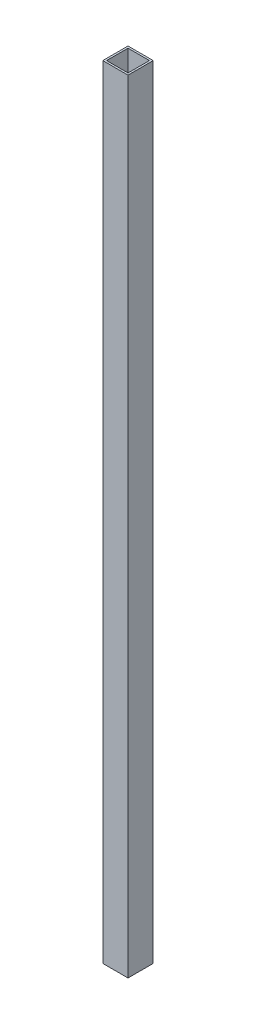
ISO-10303-21;
HEADER;
FILE_DESCRIPTION(('STEP AP214'),'2;1');
FILE_NAME('part.step','',(''),(''),'','','');
FILE_SCHEMA(('AUTOMOTIVE_DESIGN { 1 0 10303 214 1 1 1 1 }'));
ENDSEC;
DATA;
#1=APPLICATION_CONTEXT('core data for automotive mechanical design processes');
#2=APPLICATION_PROTOCOL_DEFINITION('international standard','automotive_design',2000,#1);
#3=PRODUCT_CONTEXT('',#1,'mechanical');
#4=PRODUCT('Part','Part','',(#3));
#5=PRODUCT_RELATED_PRODUCT_CATEGORY('part','',(#4));
#6=PRODUCT_DEFINITION_FORMATION('','',#4);
#7=PRODUCT_DEFINITION_CONTEXT('part definition',#1,'design');
#8=PRODUCT_DEFINITION('design','',#6,#7);
#9=PRODUCT_DEFINITION_SHAPE('','',#8);
#10=(LENGTH_UNIT() NAMED_UNIT(*) SI_UNIT(.MILLI.,.METRE.));
#11=(NAMED_UNIT(*) PLANE_ANGLE_UNIT() SI_UNIT($,.RADIAN.));
#12=(NAMED_UNIT(*) SI_UNIT($,.STERADIAN.) SOLID_ANGLE_UNIT());
#13=UNCERTAINTY_MEASURE_WITH_UNIT(LENGTH_MEASURE(1.E-05),#10,'distance_accuracy_value','');
#14=(GEOMETRIC_REPRESENTATION_CONTEXT(3) GLOBAL_UNCERTAINTY_ASSIGNED_CONTEXT((#13)) GLOBAL_UNIT_ASSIGNED_CONTEXT((#10,
#11,#12)) REPRESENTATION_CONTEXT('',''));
#15=CARTESIAN_POINT('',(0.,0.,0.));
#16=DIRECTION('',(0.,0.,1.));
#17=DIRECTION('',(1.,0.,0.));
#18=AXIS2_PLACEMENT_3D('',#15,#16,#17);
#19=CARTESIAN_POINT('',(-20.,1240.,20.));
#20=DIRECTION('',(1.,0.,0.));
#21=DIRECTION('',(0.,0.,-1.));
#22=AXIS2_PLACEMENT_3D('',#19,#20,#21);
#23=PLANE('',#22);
#24=DIRECTION('',(0.,0.,1.));
#25=VECTOR('',#24,1.);
#26=CARTESIAN_POINT('',(-20.,0.,20.));
#27=LINE('',#26,#25);
#28=CARTESIAN_POINT('',(-20.,0.,-20.));
#29=VERTEX_POINT('',#28);
#30=CARTESIAN_POINT('',(-20.,0.,20.));
#31=VERTEX_POINT('',#30);
#32=EDGE_CURVE('E129',#29,#31,#27,.T.);
#33=ORIENTED_EDGE('',*,*,#32,.T.);
#34=DIRECTION('',(0.,-1.,0.));
#35=VECTOR('',#34,1.);
#36=CARTESIAN_POINT('',(-20.,1240.,20.));
#37=LINE('',#36,#35);
#38=CARTESIAN_POINT('',(-20.,1240.,20.));
#39=VERTEX_POINT('',#38);
#40=EDGE_CURVE('E11',#39,#31,#37,.T.);
#41=ORIENTED_EDGE('',*,*,#40,.F.);
#42=DIRECTION('',(0.,0.,1.));
#43=VECTOR('',#42,1.);
#44=CARTESIAN_POINT('',(-20.,1240.,20.));
#45=LINE('',#44,#43);
#46=CARTESIAN_POINT('',(-20.,1240.,-20.));
#47=VERTEX_POINT('',#46);
#48=EDGE_CURVE('E133',#47,#39,#45,.T.);
#49=ORIENTED_EDGE('',*,*,#48,.F.);
#50=DIRECTION('',(0.,-1.,0.));
#51=VECTOR('',#50,1.);
#52=CARTESIAN_POINT('',(-20.,1240.,-20.));
#53=LINE('',#52,#51);
#54=EDGE_CURVE('E143',#47,#29,#53,.T.);
#55=ORIENTED_EDGE('',*,*,#54,.T.);
#56=EDGE_LOOP('',(#33,#41,#49,#55));
#57=FACE_BOUND('',#56,.T.);
#58=ADVANCED_FACE('F32',(#57),#23,.F.);
#59=CARTESIAN_POINT('',(20.,1240.,20.));
#60=DIRECTION('',(0.,0.,-1.));
#61=DIRECTION('',(-1.,0.,0.));
#62=AXIS2_PLACEMENT_3D('',#59,#60,#61);
#63=PLANE('',#62);
#64=DIRECTION('',(1.,0.,0.));
#65=VECTOR('',#64,1.);
#66=CARTESIAN_POINT('',(20.,0.,20.));
#67=LINE('',#66,#65);
#68=CARTESIAN_POINT('',(20.,0.,20.));
#69=VERTEX_POINT('',#68);
#70=EDGE_CURVE('E146',#31,#69,#67,.T.);
#71=ORIENTED_EDGE('',*,*,#70,.T.);
#72=DIRECTION('',(0.,-1.,0.));
#73=VECTOR('',#72,1.);
#74=CARTESIAN_POINT('',(20.,1240.,20.));
#75=LINE('',#74,#73);
#76=CARTESIAN_POINT('',(20.,1240.,20.));
#77=VERTEX_POINT('',#76);
#78=EDGE_CURVE('E39',#77,#69,#75,.T.);
#79=ORIENTED_EDGE('',*,*,#78,.F.);
#80=DIRECTION('',(1.,0.,0.));
#81=VECTOR('',#80,1.);
#82=CARTESIAN_POINT('',(20.,1240.,20.));
#83=LINE('',#82,#81);
#84=EDGE_CURVE('E136',#39,#77,#83,.T.);
#85=ORIENTED_EDGE('',*,*,#84,.F.);
#86=ORIENTED_EDGE('',*,*,#40,.T.);
#87=EDGE_LOOP('',(#71,#79,#85,#86));
#88=FACE_BOUND('',#87,.T.);
#89=ADVANCED_FACE('F174',(#88),#63,.F.);
#90=CARTESIAN_POINT('',(20.,1240.,20.));
#91=DIRECTION('',(-1.,0.,0.));
#92=DIRECTION('',(0.,0.,1.));
#93=AXIS2_PLACEMENT_3D('',#90,#91,#92);
#94=PLANE('',#93);
#95=DIRECTION('',(0.,0.,-1.));
#96=VECTOR('',#95,1.);
#97=CARTESIAN_POINT('',(20.,0.,20.));
#98=LINE('',#97,#96);
#99=CARTESIAN_POINT('',(20.,0.,-20.));
#100=VERTEX_POINT('',#99);
#101=EDGE_CURVE('E148',#69,#100,#98,.T.);
#102=ORIENTED_EDGE('',*,*,#101,.T.);
#103=DIRECTION('',(0.,-1.,0.));
#104=VECTOR('',#103,1.);
#105=CARTESIAN_POINT('',(20.,1240.,-20.));
#106=LINE('',#105,#104);
#107=CARTESIAN_POINT('',(20.,1240.,-20.));
#108=VERTEX_POINT('',#107);
#109=EDGE_CURVE('E153',#108,#100,#106,.T.);
#110=ORIENTED_EDGE('',*,*,#109,.F.);
#111=DIRECTION('',(0.,0.,-1.));
#112=VECTOR('',#111,1.);
#113=CARTESIAN_POINT('',(20.,1240.,20.));
#114=LINE('',#113,#112);
#115=EDGE_CURVE('E139',#77,#108,#114,.T.);
#116=ORIENTED_EDGE('',*,*,#115,.F.);
#117=ORIENTED_EDGE('',*,*,#78,.T.);
#118=EDGE_LOOP('',(#102,#110,#116,#117));
#119=FACE_BOUND('',#118,.T.);
#120=ADVANCED_FACE('F160',(#119),#94,.F.);
#121=CARTESIAN_POINT('',(20.,1240.,-20.));
#122=DIRECTION('',(0.,0.,1.));
#123=DIRECTION('',(1.,0.,0.));
#124=AXIS2_PLACEMENT_3D('',#121,#122,#123);
#125=PLANE('',#124);
#126=DIRECTION('',(-1.,0.,0.));
#127=VECTOR('',#126,1.);
#128=CARTESIAN_POINT('',(20.,0.,-20.));
#129=LINE('',#128,#127);
#130=EDGE_CURVE('E137',#100,#29,#129,.T.);
#131=ORIENTED_EDGE('',*,*,#130,.T.);
#132=ORIENTED_EDGE('',*,*,#54,.F.);
#133=DIRECTION('',(-1.,0.,0.));
#134=VECTOR('',#133,1.);
#135=CARTESIAN_POINT('',(20.,1240.,-20.));
#136=LINE('',#135,#134);
#137=EDGE_CURVE('E141',#108,#47,#136,.T.);
#138=ORIENTED_EDGE('',*,*,#137,.F.);
#139=ORIENTED_EDGE('',*,*,#109,.T.);
#140=EDGE_LOOP('',(#131,#132,#138,#139));
#141=FACE_BOUND('',#140,.T.);
#142=ADVANCED_FACE('F167',(#141),#125,.F.);
#143=CARTESIAN_POINT('',(-20.,1240.,-20.));
#144=DIRECTION('',(0.,1.,0.));
#145=DIRECTION('',(0.,0.,1.));
#146=AXIS2_PLACEMENT_3D('',#143,#144,#145);
#147=PLANE('',#146);
#148=DIRECTION('',(0.,0.,1.));
#149=VECTOR('',#148,1.);
#150=CARTESIAN_POINT('',(-17.,1240.,17.));
#151=LINE('',#150,#149);
#152=CARTESIAN_POINT('',(-17.,1240.,-17.));
#153=VERTEX_POINT('',#152);
#154=CARTESIAN_POINT('',(-17.,1240.,17.));
#155=VERTEX_POINT('',#154);
#156=EDGE_CURVE('E46',#153,#155,#151,.T.);
#157=ORIENTED_EDGE('',*,*,#156,.F.);
#158=DIRECTION('',(-1.,0.,0.));
#159=VECTOR('',#158,1.);
#160=CARTESIAN_POINT('',(17.,1240.,-17.));
#161=LINE('',#160,#159);
#162=CARTESIAN_POINT('',(17.,1240.,-17.));
#163=VERTEX_POINT('',#162);
#164=EDGE_CURVE('E114',#163,#153,#161,.T.);
#165=ORIENTED_EDGE('',*,*,#164,.F.);
#166=DIRECTION('',(0.,0.,-1.));
#167=VECTOR('',#166,1.);
#168=CARTESIAN_POINT('',(17.,1240.,17.));
#169=LINE('',#168,#167);
#170=CARTESIAN_POINT('',(17.,1240.,17.));
#171=VERTEX_POINT('',#170);
#172=EDGE_CURVE('E117',#171,#163,#169,.T.);
#173=ORIENTED_EDGE('',*,*,#172,.F.);
#174=DIRECTION('',(1.,0.,0.));
#175=VECTOR('',#174,1.);
#176=CARTESIAN_POINT('',(17.,1240.,17.));
#177=LINE('',#176,#175);
#178=EDGE_CURVE('E123',#155,#171,#177,.T.);
#179=ORIENTED_EDGE('',*,*,#178,.F.);
#180=EDGE_LOOP('',(#157,#165,#173,#179));
#181=FACE_BOUND('',#180,.T.);
#182=ORIENTED_EDGE('',*,*,#48,.T.);
#183=ORIENTED_EDGE('',*,*,#84,.T.);
#184=ORIENTED_EDGE('',*,*,#115,.T.);
#185=ORIENTED_EDGE('',*,*,#137,.T.);
#186=EDGE_LOOP('',(#182,#183,#184,#185));
#187=FACE_BOUND('',#186,.T.);
#188=ADVANCED_FACE('F173',(#181,#187),#147,.T.);
#189=CARTESIAN_POINT('',(-20.,0.,-20.));
#190=DIRECTION('',(0.,1.,0.));
#191=DIRECTION('',(0.,0.,1.));
#192=AXIS2_PLACEMENT_3D('',#189,#190,#191);
#193=PLANE('',#192);
#194=DIRECTION('',(-1.,0.,0.));
#195=VECTOR('',#194,1.);
#196=CARTESIAN_POINT('',(17.,0.,-17.));
#197=LINE('',#196,#195);
#198=CARTESIAN_POINT('',(17.,0.,-17.));
#199=VERTEX_POINT('',#198);
#200=CARTESIAN_POINT('',(-17.,0.,-17.));
#201=VERTEX_POINT('',#200);
#202=EDGE_CURVE('E104',#199,#201,#197,.T.);
#203=ORIENTED_EDGE('',*,*,#202,.T.);
#204=DIRECTION('',(0.,0.,1.));
#205=VECTOR('',#204,1.);
#206=CARTESIAN_POINT('',(-17.,0.,17.));
#207=LINE('',#206,#205);
#208=CARTESIAN_POINT('',(-17.,0.,17.));
#209=VERTEX_POINT('',#208);
#210=EDGE_CURVE('E98',#201,#209,#207,.T.);
#211=ORIENTED_EDGE('',*,*,#210,.T.);
#212=DIRECTION('',(1.,0.,0.));
#213=VECTOR('',#212,1.);
#214=CARTESIAN_POINT('',(17.,0.,17.));
#215=LINE('',#214,#213);
#216=CARTESIAN_POINT('',(17.,0.,17.));
#217=VERTEX_POINT('',#216);
#218=EDGE_CURVE('E107',#209,#217,#215,.T.);
#219=ORIENTED_EDGE('',*,*,#218,.T.);
#220=DIRECTION('',(0.,0.,-1.));
#221=VECTOR('',#220,1.);
#222=CARTESIAN_POINT('',(17.,0.,17.));
#223=LINE('',#222,#221);
#224=EDGE_CURVE('E54',#217,#199,#223,.T.);
#225=ORIENTED_EDGE('',*,*,#224,.T.);
#226=EDGE_LOOP('',(#203,#211,#219,#225));
#227=FACE_BOUND('',#226,.T.);
#228=ORIENTED_EDGE('',*,*,#32,.F.);
#229=ORIENTED_EDGE('',*,*,#130,.F.);
#230=ORIENTED_EDGE('',*,*,#101,.F.);
#231=ORIENTED_EDGE('',*,*,#70,.F.);
#232=EDGE_LOOP('',(#228,#229,#230,#231));
#233=FACE_BOUND('',#232,.T.);
#234=ADVANCED_FACE('F111',(#227,#233),#193,.F.);
#235=CARTESIAN_POINT('',(-17.,0.,17.));
#236=DIRECTION('',(-1.,0.,0.));
#237=DIRECTION('',(0.,0.,1.));
#238=AXIS2_PLACEMENT_3D('',#235,#236,#237);
#239=PLANE('',#238);
#240=ORIENTED_EDGE('',*,*,#156,.T.);
#241=DIRECTION('',(0.,1.,0.));
#242=VECTOR('',#241,1.);
#243=CARTESIAN_POINT('',(-17.,0.,17.));
#244=LINE('',#243,#242);
#245=EDGE_CURVE('E94',#209,#155,#244,.T.);
#246=ORIENTED_EDGE('',*,*,#245,.F.);
#247=ORIENTED_EDGE('',*,*,#210,.F.);
#248=DIRECTION('',(0.,1.,0.));
#249=VECTOR('',#248,1.);
#250=CARTESIAN_POINT('',(-17.,0.,-17.));
#251=LINE('',#250,#249);
#252=EDGE_CURVE('E127',#201,#153,#251,.T.);
#253=ORIENTED_EDGE('',*,*,#252,.T.);
#254=EDGE_LOOP('',(#240,#246,#247,#253));
#255=FACE_BOUND('',#254,.T.);
#256=ADVANCED_FACE('F96',(#255),#239,.F.);
#257=CARTESIAN_POINT('',(17.,0.,-17.));
#258=DIRECTION('',(0.,0.,-1.));
#259=DIRECTION('',(-1.,0.,0.));
#260=AXIS2_PLACEMENT_3D('',#257,#258,#259);
#261=PLANE('',#260);
#262=ORIENTED_EDGE('',*,*,#164,.T.);
#263=ORIENTED_EDGE('',*,*,#252,.F.);
#264=ORIENTED_EDGE('',*,*,#202,.F.);
#265=DIRECTION('',(0.,1.,0.));
#266=VECTOR('',#265,1.);
#267=CARTESIAN_POINT('',(17.,0.,-17.));
#268=LINE('',#267,#266);
#269=EDGE_CURVE('E130',#199,#163,#268,.T.);
#270=ORIENTED_EDGE('',*,*,#269,.T.);
#271=EDGE_LOOP('',(#262,#263,#264,#270));
#272=FACE_BOUND('',#271,.T.);
#273=ADVANCED_FACE('F191',(#272),#261,.F.);
#274=CARTESIAN_POINT('',(17.,0.,17.));
#275=DIRECTION('',(1.,0.,0.));
#276=DIRECTION('',(0.,0.,-1.));
#277=AXIS2_PLACEMENT_3D('',#274,#275,#276);
#278=PLANE('',#277);
#279=ORIENTED_EDGE('',*,*,#172,.T.);
#280=ORIENTED_EDGE('',*,*,#269,.F.);
#281=ORIENTED_EDGE('',*,*,#224,.F.);
#282=DIRECTION('',(0.,1.,0.));
#283=VECTOR('',#282,1.);
#284=CARTESIAN_POINT('',(17.,0.,17.));
#285=LINE('',#284,#283);
#286=EDGE_CURVE('E103',#217,#171,#285,.T.);
#287=ORIENTED_EDGE('',*,*,#286,.T.);
#288=EDGE_LOOP('',(#279,#280,#281,#287));
#289=FACE_BOUND('',#288,.T.);
#290=ADVANCED_FACE('F194',(#289),#278,.F.);
#291=CARTESIAN_POINT('',(17.,0.,17.));
#292=DIRECTION('',(0.,0.,1.));
#293=DIRECTION('',(1.,0.,0.));
#294=AXIS2_PLACEMENT_3D('',#291,#292,#293);
#295=PLANE('',#294);
#296=ORIENTED_EDGE('',*,*,#178,.T.);
#297=ORIENTED_EDGE('',*,*,#286,.F.);
#298=ORIENTED_EDGE('',*,*,#218,.F.);
#299=ORIENTED_EDGE('',*,*,#245,.T.);
#300=EDGE_LOOP('',(#296,#297,#298,#299));
#301=FACE_BOUND('',#300,.T.);
#302=ADVANCED_FACE('F108',(#301),#295,.F.);
#303=CLOSED_SHELL('',(#58,#89,#120,#142,#188,#234,#256,#273,#290,#302));
#304=MANIFOLD_SOLID_BREP('B2',#303);
#305=ADVANCED_BREP_SHAPE_REPRESENTATION('',(#18,#304),#14);
#306=SHAPE_DEFINITION_REPRESENTATION(#9,#305);
ENDSEC;
END-ISO-10303-21;
